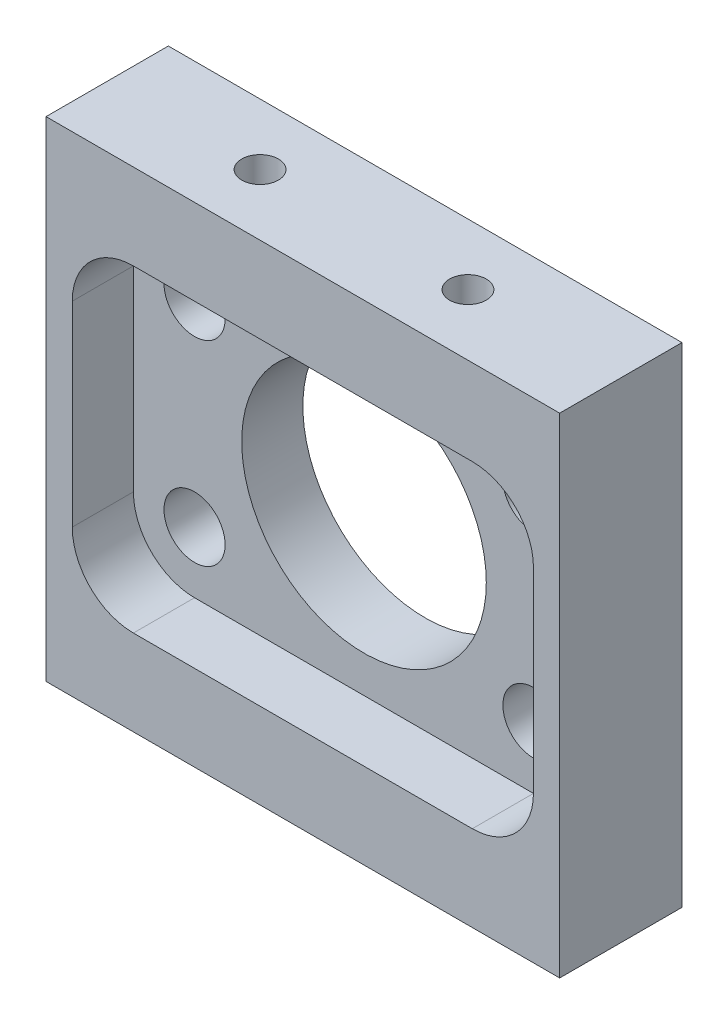
ISO-10303-21;
HEADER;
FILE_DESCRIPTION(('STEP AP214'),'2;1');
FILE_NAME('part.step','',(''),(''),'','','');
FILE_SCHEMA(('AUTOMOTIVE_DESIGN { 1 0 10303 214 1 1 1 1 }'));
ENDSEC;
DATA;
#1=APPLICATION_CONTEXT('core data for automotive mechanical design processes');
#2=APPLICATION_PROTOCOL_DEFINITION('international standard','automotive_design',2000,#1);
#3=PRODUCT_CONTEXT('',#1,'mechanical');
#4=PRODUCT('Part','Part','',(#3));
#5=PRODUCT_RELATED_PRODUCT_CATEGORY('part','',(#4));
#6=PRODUCT_DEFINITION_FORMATION('','',#4);
#7=PRODUCT_DEFINITION_CONTEXT('part definition',#1,'design');
#8=PRODUCT_DEFINITION('design','',#6,#7);
#9=PRODUCT_DEFINITION_SHAPE('','',#8);
#10=(LENGTH_UNIT() NAMED_UNIT(*) SI_UNIT(.MILLI.,.METRE.));
#11=(NAMED_UNIT(*) PLANE_ANGLE_UNIT() SI_UNIT($,.RADIAN.));
#12=(NAMED_UNIT(*) SI_UNIT($,.STERADIAN.) SOLID_ANGLE_UNIT());
#13=UNCERTAINTY_MEASURE_WITH_UNIT(LENGTH_MEASURE(1.E-05),#10,'distance_accuracy_value','');
#14=(GEOMETRIC_REPRESENTATION_CONTEXT(3) GLOBAL_UNCERTAINTY_ASSIGNED_CONTEXT((#13)) GLOBAL_UNIT_ASSIGNED_CONTEXT((#10,
#11,#12)) REPRESENTATION_CONTEXT('',''));
#15=CARTESIAN_POINT('',(0.,0.,0.));
#16=DIRECTION('',(0.,0.,1.));
#17=DIRECTION('',(1.,0.,0.));
#18=AXIS2_PLACEMENT_3D('',#15,#16,#17);
#19=CARTESIAN_POINT('',(0.,-10.,2.5));
#20=DIRECTION('',(0.,1.,0.));
#21=DIRECTION('',(0.,0.,1.));
#22=AXIS2_PLACEMENT_3D('',#19,#20,#21);
#23=PLANE('',#22);
#24=CARTESIAN_POINT('',(-4.25,-10.,0.));
#25=DIRECTION('',(0.,1.,0.));
#26=DIRECTION('',(0.,0.,1.));
#27=AXIS2_PLACEMENT_3D('',#24,#25,#26);
#28=CIRCLE('',#27,0.749999999999999);
#29=CARTESIAN_POINT('',(-4.25,-10.,0.749999999999999));
#30=VERTEX_POINT('',#29);
#31=EDGE_CURVE('E484',#30,#30,#28,.T.);
#32=ORIENTED_EDGE('',*,*,#31,.T.);
#33=EDGE_LOOP('',(#32));
#34=FACE_BOUND('',#33,.T.);
#35=DIRECTION('',(1.,0.,0.));
#36=VECTOR('',#35,1.);
#37=CARTESIAN_POINT('',(0.,-10.,-2.5));
#38=LINE('',#37,#36);
#39=CARTESIAN_POINT('',(-10.5,-10.,-2.5));
#40=VERTEX_POINT('',#39);
#41=CARTESIAN_POINT('',(10.5,-10.,-2.5));
#42=VERTEX_POINT('',#41);
#43=EDGE_CURVE('E229',#40,#42,#38,.T.);
#44=ORIENTED_EDGE('',*,*,#43,.T.);
#45=DIRECTION('',(0.,0.,-1.));
#46=VECTOR('',#45,1.);
#47=CARTESIAN_POINT('',(10.5,-10.,2.5));
#48=LINE('',#47,#46);
#49=CARTESIAN_POINT('',(10.5,-10.,2.5));
#50=VERTEX_POINT('',#49);
#51=EDGE_CURVE('E79',#50,#42,#48,.T.);
#52=ORIENTED_EDGE('',*,*,#51,.F.);
#53=DIRECTION('',(1.,0.,0.));
#54=VECTOR('',#53,1.);
#55=CARTESIAN_POINT('',(0.,-10.,2.5));
#56=LINE('',#55,#54);
#57=CARTESIAN_POINT('',(-10.5,-10.,2.5));
#58=VERTEX_POINT('',#57);
#59=EDGE_CURVE('E59',#58,#50,#56,.T.);
#60=ORIENTED_EDGE('',*,*,#59,.F.);
#61=DIRECTION('',(0.,0.,-1.));
#62=VECTOR('',#61,1.);
#63=CARTESIAN_POINT('',(-10.5,-10.,2.5));
#64=LINE('',#63,#62);
#65=EDGE_CURVE('E246',#58,#40,#64,.T.);
#66=ORIENTED_EDGE('',*,*,#65,.T.);
#67=EDGE_LOOP('',(#44,#52,#60,#66));
#68=FACE_BOUND('',#67,.T.);
#69=CARTESIAN_POINT('',(4.25,-10.,0.));
#70=DIRECTION('',(0.,1.,0.));
#71=DIRECTION('',(0.,0.,1.));
#72=AXIS2_PLACEMENT_3D('',#69,#70,#71);
#73=CIRCLE('',#72,0.750000000000001);
#74=CARTESIAN_POINT('',(4.25,-10.,0.750000000000001));
#75=VERTEX_POINT('',#74);
#76=EDGE_CURVE('E485',#75,#75,#73,.T.);
#77=ORIENTED_EDGE('',*,*,#76,.T.);
#78=EDGE_LOOP('',(#77));
#79=FACE_BOUND('',#78,.T.);
#80=ADVANCED_FACE('F34',(#34,#68,#79),#23,.F.);
#81=CARTESIAN_POINT('',(6.92820323027552,3.99999999999999,2.5));
#82=DIRECTION('',(0.,0.,-1.));
#83=DIRECTION('',(-1.,0.,0.));
#84=AXIS2_PLACEMENT_3D('',#81,#82,#83);
#85=CYLINDRICAL_SURFACE('',#84,1.25);
#86=CARTESIAN_POINT('',(6.92820323027552,3.99999999999999,-2.5));
#87=DIRECTION('',(0.,0.,1.));
#88=DIRECTION('',(1.,0.,0.));
#89=AXIS2_PLACEMENT_3D('',#86,#87,#88);
#90=CIRCLE('',#89,1.25);
#91=CARTESIAN_POINT('',(8.17820323027552,3.99999999999999,-2.5));
#92=VERTEX_POINT('',#91);
#93=EDGE_CURVE('E240',#92,#92,#90,.T.);
#94=ORIENTED_EDGE('',*,*,#93,.F.);
#95=EDGE_LOOP('',(#94));
#96=FACE_BOUND('',#95,.T.);
#97=CARTESIAN_POINT('',(6.92820323027552,3.99999999999999,0.));
#98=DIRECTION('',(0.,0.,1.));
#99=DIRECTION('',(1.,0.,0.));
#100=AXIS2_PLACEMENT_3D('',#97,#98,#99);
#101=CIRCLE('',#100,1.25);
#102=CARTESIAN_POINT('',(8.17820323027552,3.99999999999999,0.));
#103=VERTEX_POINT('',#102);
#104=EDGE_CURVE('E209',#103,#103,#101,.T.);
#105=ORIENTED_EDGE('',*,*,#104,.T.);
#106=EDGE_LOOP('',(#105));
#107=FACE_BOUND('',#106,.T.);
#108=ADVANCED_FACE('F272',(#96,#107),#85,.F.);
#109=CARTESIAN_POINT('',(-6.92820323027552,-3.99999999999998,2.5));
#110=DIRECTION('',(0.,0.,-1.));
#111=DIRECTION('',(-1.,0.,0.));
#112=AXIS2_PLACEMENT_3D('',#109,#110,#111);
#113=CYLINDRICAL_SURFACE('',#112,1.25);
#114=CARTESIAN_POINT('',(-6.92820323027552,-3.99999999999998,-2.5));
#115=DIRECTION('',(0.,0.,1.));
#116=DIRECTION('',(1.,0.,0.));
#117=AXIS2_PLACEMENT_3D('',#114,#115,#116);
#118=CIRCLE('',#117,1.25);
#119=CARTESIAN_POINT('',(-5.67820323027552,-3.99999999999998,-2.5));
#120=VERTEX_POINT('',#119);
#121=EDGE_CURVE('E237',#120,#120,#118,.T.);
#122=ORIENTED_EDGE('',*,*,#121,.F.);
#123=EDGE_LOOP('',(#122));
#124=FACE_BOUND('',#123,.T.);
#125=CARTESIAN_POINT('',(-6.92820323027552,-3.99999999999998,0.));
#126=DIRECTION('',(0.,0.,1.));
#127=DIRECTION('',(1.,0.,0.));
#128=AXIS2_PLACEMENT_3D('',#125,#126,#127);
#129=CIRCLE('',#128,1.25);
#130=CARTESIAN_POINT('',(-5.67820323027552,-3.99999999999998,0.));
#131=VERTEX_POINT('',#130);
#132=EDGE_CURVE('E206',#131,#131,#129,.T.);
#133=ORIENTED_EDGE('',*,*,#132,.T.);
#134=EDGE_LOOP('',(#133));
#135=FACE_BOUND('',#134,.T.);
#136=ADVANCED_FACE('F278',(#124,#135),#113,.F.);
#137=CARTESIAN_POINT('',(-6.92820323027552,3.99999999999999,2.5));
#138=DIRECTION('',(0.,0.,-1.));
#139=DIRECTION('',(-1.,0.,0.));
#140=AXIS2_PLACEMENT_3D('',#137,#138,#139);
#141=CYLINDRICAL_SURFACE('',#140,1.25);
#142=CARTESIAN_POINT('',(-6.92820323027552,3.99999999999999,-2.5));
#143=DIRECTION('',(0.,0.,1.));
#144=DIRECTION('',(1.,0.,0.));
#145=AXIS2_PLACEMENT_3D('',#142,#143,#144);
#146=CIRCLE('',#145,1.25);
#147=CARTESIAN_POINT('',(-5.67820323027552,3.99999999999999,-2.5));
#148=VERTEX_POINT('',#147);
#149=EDGE_CURVE('E234',#148,#148,#146,.T.);
#150=ORIENTED_EDGE('',*,*,#149,.F.);
#151=EDGE_LOOP('',(#150));
#152=FACE_BOUND('',#151,.T.);
#153=CARTESIAN_POINT('',(-6.92820323027552,3.99999999999999,0.));
#154=DIRECTION('',(0.,0.,1.));
#155=DIRECTION('',(1.,0.,0.));
#156=AXIS2_PLACEMENT_3D('',#153,#154,#155);
#157=CIRCLE('',#156,1.25);
#158=CARTESIAN_POINT('',(-5.67820323027552,3.99999999999999,0.));
#159=VERTEX_POINT('',#158);
#160=EDGE_CURVE('E203',#159,#159,#157,.T.);
#161=ORIENTED_EDGE('',*,*,#160,.T.);
#162=EDGE_LOOP('',(#161));
#163=FACE_BOUND('',#162,.T.);
#164=ADVANCED_FACE('F301',(#152,#163),#141,.F.);
#165=CARTESIAN_POINT('',(6.92820323027552,-3.99999999999999,2.5));
#166=DIRECTION('',(0.,0.,-1.));
#167=DIRECTION('',(-1.,0.,0.));
#168=AXIS2_PLACEMENT_3D('',#165,#166,#167);
#169=CYLINDRICAL_SURFACE('',#168,1.25);
#170=CARTESIAN_POINT('',(6.92820323027552,-3.99999999999999,-2.5));
#171=DIRECTION('',(0.,0.,1.));
#172=DIRECTION('',(1.,0.,0.));
#173=AXIS2_PLACEMENT_3D('',#170,#171,#172);
#174=CIRCLE('',#173,1.25);
#175=CARTESIAN_POINT('',(8.17820323027552,-3.99999999999999,-2.5));
#176=VERTEX_POINT('',#175);
#177=EDGE_CURVE('E231',#176,#176,#174,.T.);
#178=ORIENTED_EDGE('',*,*,#177,.F.);
#179=EDGE_LOOP('',(#178));
#180=FACE_BOUND('',#179,.T.);
#181=CARTESIAN_POINT('',(6.92820323027552,-3.99999999999999,0.));
#182=DIRECTION('',(0.,0.,1.));
#183=DIRECTION('',(1.,0.,0.));
#184=AXIS2_PLACEMENT_3D('',#181,#182,#183);
#185=CIRCLE('',#184,1.25);
#186=CARTESIAN_POINT('',(8.17820323027552,-3.99999999999999,0.));
#187=VERTEX_POINT('',#186);
#188=EDGE_CURVE('E200',#187,#187,#185,.T.);
#189=ORIENTED_EDGE('',*,*,#188,.T.);
#190=EDGE_LOOP('',(#189));
#191=FACE_BOUND('',#190,.T.);
#192=ADVANCED_FACE('F285',(#180,#191),#169,.F.);
#193=CARTESIAN_POINT('',(0.,0.,2.5));
#194=DIRECTION('',(0.,0.,-1.));
#195=DIRECTION('',(-1.,0.,0.));
#196=AXIS2_PLACEMENT_3D('',#193,#194,#195);
#197=CYLINDRICAL_SURFACE('',#196,5.);
#198=CARTESIAN_POINT('',(0.,0.,-2.5));
#199=DIRECTION('',(0.,0.,1.));
#200=DIRECTION('',(1.,0.,0.));
#201=AXIS2_PLACEMENT_3D('',#198,#199,#200);
#202=CIRCLE('',#201,5.);
#203=CARTESIAN_POINT('',(5.,0.,-2.5));
#204=VERTEX_POINT('',#203);
#205=EDGE_CURVE('E216',#204,#204,#202,.T.);
#206=ORIENTED_EDGE('',*,*,#205,.F.);
#207=EDGE_LOOP('',(#206));
#208=FACE_BOUND('',#207,.T.);
#209=CARTESIAN_POINT('',(0.,0.,0.));
#210=DIRECTION('',(0.,0.,1.));
#211=DIRECTION('',(1.,0.,0.));
#212=AXIS2_PLACEMENT_3D('',#209,#210,#211);
#213=CIRCLE('',#212,5.);
#214=CARTESIAN_POINT('',(5.,0.,0.));
#215=VERTEX_POINT('',#214);
#216=EDGE_CURVE('E38',#215,#215,#213,.T.);
#217=ORIENTED_EDGE('',*,*,#216,.T.);
#218=EDGE_LOOP('',(#217));
#219=FACE_BOUND('',#218,.T.);
#220=ADVANCED_FACE('F269',(#208,#219),#197,.F.);
#221=CARTESIAN_POINT('',(0.,0.,2.5));
#222=DIRECTION('',(0.,0.,1.));
#223=DIRECTION('',(1.,0.,0.));
#224=AXIS2_PLACEMENT_3D('',#221,#222,#223);
#225=PLANE('',#224);
#226=DIRECTION('',(0.,-1.,0.));
#227=VECTOR('',#226,1.);
#228=CARTESIAN_POINT('',(10.5,0.,2.5));
#229=LINE('',#228,#227);
#230=CARTESIAN_POINT('',(10.5,10.,2.5));
#231=VERTEX_POINT('',#230);
#232=EDGE_CURVE('E213',#231,#50,#229,.T.);
#233=ORIENTED_EDGE('',*,*,#232,.F.);
#234=DIRECTION('',(1.,0.,0.));
#235=VECTOR('',#234,1.);
#236=CARTESIAN_POINT('',(0.,10.,2.5));
#237=LINE('',#236,#235);
#238=CARTESIAN_POINT('',(-10.5,10.,2.5));
#239=VERTEX_POINT('',#238);
#240=EDGE_CURVE('E215',#239,#231,#237,.T.);
#241=ORIENTED_EDGE('',*,*,#240,.F.);
#242=DIRECTION('',(0.,-1.,0.));
#243=VECTOR('',#242,1.);
#244=CARTESIAN_POINT('',(-10.5,0.,2.5));
#245=LINE('',#244,#243);
#246=EDGE_CURVE('E219',#239,#58,#245,.T.);
#247=ORIENTED_EDGE('',*,*,#246,.T.);
#248=ORIENTED_EDGE('',*,*,#59,.T.);
#249=EDGE_LOOP('',(#233,#241,#247,#248));
#250=FACE_BOUND('',#249,.T.);
#251=CARTESIAN_POINT('',(-6.92820323027552,-3.99999999999998,2.5));
#252=DIRECTION('',(0.,0.,1.));
#253=DIRECTION('',(1.,0.,0.));
#254=AXIS2_PLACEMENT_3D('',#251,#252,#253);
#255=CIRCLE('',#254,2.5);
#256=CARTESIAN_POINT('',(-9.42820323027552,-3.99999999999998,2.5));
#257=VERTEX_POINT('',#256);
#258=CARTESIAN_POINT('',(-6.92820323027551,-6.49999999999999,2.5));
#259=VERTEX_POINT('',#258);
#260=EDGE_CURVE('E138',#257,#259,#255,.T.);
#261=ORIENTED_EDGE('',*,*,#260,.F.);
#262=DIRECTION('',(0.,1.,0.));
#263=VECTOR('',#262,1.);
#264=CARTESIAN_POINT('',(-9.42820323027552,0.,2.5));
#265=LINE('',#264,#263);
#266=CARTESIAN_POINT('',(-9.42820323027552,3.99999999999998,2.5));
#267=VERTEX_POINT('',#266);
#268=EDGE_CURVE('E50',#257,#267,#265,.T.);
#269=ORIENTED_EDGE('',*,*,#268,.T.);
#270=CARTESIAN_POINT('',(-6.92820323027552,3.99999999999999,2.5));
#271=DIRECTION('',(0.,0.,1.));
#272=DIRECTION('',(1.,0.,0.));
#273=AXIS2_PLACEMENT_3D('',#270,#271,#272);
#274=CIRCLE('',#273,2.5);
#275=CARTESIAN_POINT('',(-6.92820323027552,6.49999999999999,2.5));
#276=VERTEX_POINT('',#275);
#277=EDGE_CURVE('E145',#276,#267,#274,.T.);
#278=ORIENTED_EDGE('',*,*,#277,.F.);
#279=DIRECTION('',(-1.,0.,0.));
#280=VECTOR('',#279,1.);
#281=CARTESIAN_POINT('',(0.,6.49999999999999,2.5));
#282=LINE('',#281,#280);
#283=CARTESIAN_POINT('',(6.92820323027552,6.49999999999999,2.5));
#284=VERTEX_POINT('',#283);
#285=EDGE_CURVE('E171',#284,#276,#282,.T.);
#286=ORIENTED_EDGE('',*,*,#285,.F.);
#287=CARTESIAN_POINT('',(6.92820323027552,3.99999999999999,2.5));
#288=DIRECTION('',(0.,0.,1.));
#289=DIRECTION('',(1.,0.,0.));
#290=AXIS2_PLACEMENT_3D('',#287,#288,#289);
#291=CIRCLE('',#290,2.50000000000001);
#292=CARTESIAN_POINT('',(9.42820323027552,3.99999999999999,2.5));
#293=VERTEX_POINT('',#292);
#294=EDGE_CURVE('E174',#293,#284,#291,.T.);
#295=ORIENTED_EDGE('',*,*,#294,.F.);
#296=DIRECTION('',(0.,1.,0.));
#297=VECTOR('',#296,1.);
#298=CARTESIAN_POINT('',(9.42820323027553,0.,2.5));
#299=LINE('',#298,#297);
#300=CARTESIAN_POINT('',(9.42820323027553,-3.99999999999999,2.5));
#301=VERTEX_POINT('',#300);
#302=EDGE_CURVE('E177',#301,#293,#299,.T.);
#303=ORIENTED_EDGE('',*,*,#302,.F.);
#304=CARTESIAN_POINT('',(6.92820323027552,-3.99999999999999,2.5));
#305=DIRECTION('',(0.,0.,1.));
#306=DIRECTION('',(1.,0.,0.));
#307=AXIS2_PLACEMENT_3D('',#304,#305,#306);
#308=CIRCLE('',#307,2.50000000000001);
#309=CARTESIAN_POINT('',(6.92820323027552,-6.49999999999999,2.5));
#310=VERTEX_POINT('',#309);
#311=EDGE_CURVE('E180',#310,#301,#308,.T.);
#312=ORIENTED_EDGE('',*,*,#311,.F.);
#313=DIRECTION('',(-1.,0.,0.));
#314=VECTOR('',#313,1.);
#315=CARTESIAN_POINT('',(0.,-6.49999999999999,2.5));
#316=LINE('',#315,#314);
#317=EDGE_CURVE('E183',#310,#259,#316,.T.);
#318=ORIENTED_EDGE('',*,*,#317,.T.);
#319=EDGE_LOOP('',(#261,#269,#278,#286,#295,#303,#312,#318));
#320=FACE_BOUND('',#319,.T.);
#321=ADVANCED_FACE('F263',(#250,#320),#225,.T.);
#322=CARTESIAN_POINT('',(10.5,0.,2.5));
#323=DIRECTION('',(1.,0.,0.));
#324=DIRECTION('',(0.,0.,-1.));
#325=AXIS2_PLACEMENT_3D('',#322,#323,#324);
#326=PLANE('',#325);
#327=DIRECTION('',(0.,-1.,0.));
#328=VECTOR('',#327,1.);
#329=CARTESIAN_POINT('',(10.5,0.,-2.5));
#330=LINE('',#329,#328);
#331=CARTESIAN_POINT('',(10.5,10.,-2.5));
#332=VERTEX_POINT('',#331);
#333=EDGE_CURVE('E212',#332,#42,#330,.T.);
#334=ORIENTED_EDGE('',*,*,#333,.F.);
#335=DIRECTION('',(0.,0.,-1.));
#336=VECTOR('',#335,1.);
#337=CARTESIAN_POINT('',(10.5,10.,2.5));
#338=LINE('',#337,#336);
#339=EDGE_CURVE('E11',#231,#332,#338,.T.);
#340=ORIENTED_EDGE('',*,*,#339,.F.);
#341=ORIENTED_EDGE('',*,*,#232,.T.);
#342=ORIENTED_EDGE('',*,*,#51,.T.);
#343=EDGE_LOOP('',(#334,#340,#341,#342));
#344=FACE_BOUND('',#343,.T.);
#345=ADVANCED_FACE('F36',(#344),#326,.T.);
#346=CARTESIAN_POINT('',(0.,10.,2.5));
#347=DIRECTION('',(0.,1.,0.));
#348=DIRECTION('',(0.,0.,1.));
#349=AXIS2_PLACEMENT_3D('',#346,#347,#348);
#350=PLANE('',#349);
#351=CARTESIAN_POINT('',(4.25,10.,0.));
#352=DIRECTION('',(0.,1.,0.));
#353=DIRECTION('',(0.,0.,1.));
#354=AXIS2_PLACEMENT_3D('',#351,#352,#353);
#355=CIRCLE('',#354,0.750000000000001);
#356=CARTESIAN_POINT('',(4.25,10.,0.750000000000001));
#357=VERTEX_POINT('',#356);
#358=EDGE_CURVE('E493',#357,#357,#355,.T.);
#359=ORIENTED_EDGE('',*,*,#358,.F.);
#360=EDGE_LOOP('',(#359));
#361=FACE_BOUND('',#360,.T.);
#362=CARTESIAN_POINT('',(-4.25,10.,0.));
#363=DIRECTION('',(0.,1.,0.));
#364=DIRECTION('',(0.,0.,1.));
#365=AXIS2_PLACEMENT_3D('',#362,#363,#364);
#366=CIRCLE('',#365,0.749999999999999);
#367=CARTESIAN_POINT('',(-4.25,10.,0.749999999999999));
#368=VERTEX_POINT('',#367);
#369=EDGE_CURVE('E498',#368,#368,#366,.T.);
#370=ORIENTED_EDGE('',*,*,#369,.F.);
#371=EDGE_LOOP('',(#370));
#372=FACE_BOUND('',#371,.T.);
#373=DIRECTION('',(1.,0.,0.));
#374=VECTOR('',#373,1.);
#375=CARTESIAN_POINT('',(0.,10.,-2.5));
#376=LINE('',#375,#374);
#377=CARTESIAN_POINT('',(-10.5,10.,-2.5));
#378=VERTEX_POINT('',#377);
#379=EDGE_CURVE('E224',#378,#332,#376,.T.);
#380=ORIENTED_EDGE('',*,*,#379,.F.);
#381=DIRECTION('',(0.,0.,-1.));
#382=VECTOR('',#381,1.);
#383=CARTESIAN_POINT('',(-10.5,10.,2.5));
#384=LINE('',#383,#382);
#385=EDGE_CURVE('E43',#239,#378,#384,.T.);
#386=ORIENTED_EDGE('',*,*,#385,.F.);
#387=ORIENTED_EDGE('',*,*,#240,.T.);
#388=ORIENTED_EDGE('',*,*,#339,.T.);
#389=EDGE_LOOP('',(#380,#386,#387,#388));
#390=FACE_BOUND('',#389,.T.);
#391=ADVANCED_FACE('F261',(#361,#372,#390),#350,.T.);
#392=CARTESIAN_POINT('',(-10.5,0.,2.5));
#393=DIRECTION('',(1.,0.,0.));
#394=DIRECTION('',(0.,0.,-1.));
#395=AXIS2_PLACEMENT_3D('',#392,#393,#394);
#396=PLANE('',#395);
#397=DIRECTION('',(0.,-1.,0.));
#398=VECTOR('',#397,1.);
#399=CARTESIAN_POINT('',(-10.5,0.,-2.5));
#400=LINE('',#399,#398);
#401=EDGE_CURVE('E227',#378,#40,#400,.T.);
#402=ORIENTED_EDGE('',*,*,#401,.T.);
#403=ORIENTED_EDGE('',*,*,#65,.F.);
#404=ORIENTED_EDGE('',*,*,#246,.F.);
#405=ORIENTED_EDGE('',*,*,#385,.T.);
#406=EDGE_LOOP('',(#402,#403,#404,#405));
#407=FACE_BOUND('',#406,.T.);
#408=ADVANCED_FACE('F252',(#407),#396,.F.);
#409=CARTESIAN_POINT('',(0.,0.,-2.5));
#410=DIRECTION('',(0.,0.,1.));
#411=DIRECTION('',(1.,0.,0.));
#412=AXIS2_PLACEMENT_3D('',#409,#410,#411);
#413=PLANE('',#412);
#414=ORIENTED_EDGE('',*,*,#333,.T.);
#415=ORIENTED_EDGE('',*,*,#43,.F.);
#416=ORIENTED_EDGE('',*,*,#401,.F.);
#417=ORIENTED_EDGE('',*,*,#379,.T.);
#418=EDGE_LOOP('',(#414,#415,#416,#417));
#419=FACE_BOUND('',#418,.T.);
#420=ORIENTED_EDGE('',*,*,#177,.T.);
#421=EDGE_LOOP('',(#420));
#422=FACE_BOUND('',#421,.T.);
#423=ORIENTED_EDGE('',*,*,#149,.T.);
#424=EDGE_LOOP('',(#423));
#425=FACE_BOUND('',#424,.T.);
#426=ORIENTED_EDGE('',*,*,#121,.T.);
#427=EDGE_LOOP('',(#426));
#428=FACE_BOUND('',#427,.T.);
#429=ORIENTED_EDGE('',*,*,#93,.T.);
#430=EDGE_LOOP('',(#429));
#431=FACE_BOUND('',#430,.T.);
#432=ORIENTED_EDGE('',*,*,#205,.T.);
#433=EDGE_LOOP('',(#432));
#434=FACE_BOUND('',#433,.T.);
#435=ADVANCED_FACE('F259',(#419,#422,#425,#428,#431,#434),#413,.F.);
#436=CARTESIAN_POINT('',(-9.42820323027552,0.,0.));
#437=DIRECTION('',(1.,0.,0.));
#438=DIRECTION('',(0.,1.,0.));
#439=AXIS2_PLACEMENT_3D('',#436,#437,#438);
#440=PLANE('',#439);
#441=ORIENTED_EDGE('',*,*,#268,.F.);
#442=DIRECTION('',(0.,0.,1.));
#443=VECTOR('',#442,1.);
#444=CARTESIAN_POINT('',(-9.42820323027552,-3.99999999999998,0.));
#445=LINE('',#444,#443);
#446=CARTESIAN_POINT('',(-9.42820323027552,-3.99999999999998,0.));
#447=VERTEX_POINT('',#446);
#448=EDGE_CURVE('E132',#447,#257,#445,.T.);
#449=ORIENTED_EDGE('',*,*,#448,.F.);
#450=DIRECTION('',(0.,1.,0.));
#451=VECTOR('',#450,1.);
#452=CARTESIAN_POINT('',(-9.42820323027552,0.,0.));
#453=LINE('',#452,#451);
#454=CARTESIAN_POINT('',(-9.42820323027552,3.99999999999998,0.));
#455=VERTEX_POINT('',#454);
#456=EDGE_CURVE('E127',#447,#455,#453,.T.);
#457=ORIENTED_EDGE('',*,*,#456,.T.);
#458=DIRECTION('',(0.,0.,1.));
#459=VECTOR('',#458,1.);
#460=CARTESIAN_POINT('',(-9.42820323027552,3.99999999999998,0.));
#461=LINE('',#460,#459);
#462=EDGE_CURVE('E130',#455,#267,#461,.T.);
#463=ORIENTED_EDGE('',*,*,#462,.T.);
#464=EDGE_LOOP('',(#441,#449,#457,#463));
#465=FACE_BOUND('',#464,.T.);
#466=ADVANCED_FACE('F129',(#465),#440,.T.);
#467=CARTESIAN_POINT('',(-6.92820323027552,3.99999999999999,0.));
#468=DIRECTION('',(0.,0.,1.));
#469=DIRECTION('',(1.,0.,0.));
#470=AXIS2_PLACEMENT_3D('',#467,#468,#469);
#471=CYLINDRICAL_SURFACE('',#470,2.5);
#472=ORIENTED_EDGE('',*,*,#277,.T.);
#473=ORIENTED_EDGE('',*,*,#462,.F.);
#474=CARTESIAN_POINT('',(-6.92820323027552,3.99999999999999,0.));
#475=DIRECTION('',(0.,0.,1.));
#476=DIRECTION('',(1.,0.,0.));
#477=AXIS2_PLACEMENT_3D('',#474,#475,#476);
#478=CIRCLE('',#477,2.5);
#479=CARTESIAN_POINT('',(-6.92820323027552,6.49999999999999,0.));
#480=VERTEX_POINT('',#479);
#481=EDGE_CURVE('E137',#480,#455,#478,.T.);
#482=ORIENTED_EDGE('',*,*,#481,.F.);
#483=DIRECTION('',(0.,0.,1.));
#484=VECTOR('',#483,1.);
#485=CARTESIAN_POINT('',(-6.92820323027552,6.49999999999999,0.));
#486=LINE('',#485,#484);
#487=EDGE_CURVE('E146',#480,#276,#486,.T.);
#488=ORIENTED_EDGE('',*,*,#487,.T.);
#489=EDGE_LOOP('',(#472,#473,#482,#488));
#490=FACE_BOUND('',#489,.T.);
#491=ADVANCED_FACE('F142',(#490),#471,.F.);
#492=CARTESIAN_POINT('',(0.,6.49999999999999,0.));
#493=DIRECTION('',(0.,1.,0.));
#494=DIRECTION('',(-1.,0.,0.));
#495=AXIS2_PLACEMENT_3D('',#492,#493,#494);
#496=PLANE('',#495);
#497=ORIENTED_EDGE('',*,*,#285,.T.);
#498=ORIENTED_EDGE('',*,*,#487,.F.);
#499=DIRECTION('',(-1.,0.,0.));
#500=VECTOR('',#499,1.);
#501=CARTESIAN_POINT('',(0.,6.49999999999999,0.));
#502=LINE('',#501,#500);
#503=CARTESIAN_POINT('',(6.92820323027552,6.49999999999999,0.));
#504=VERTEX_POINT('',#503);
#505=EDGE_CURVE('E151',#504,#480,#502,.T.);
#506=ORIENTED_EDGE('',*,*,#505,.F.);
#507=DIRECTION('',(0.,0.,1.));
#508=VECTOR('',#507,1.);
#509=CARTESIAN_POINT('',(6.92820323027552,6.49999999999999,0.));
#510=LINE('',#509,#508);
#511=EDGE_CURVE('E197',#504,#284,#510,.T.);
#512=ORIENTED_EDGE('',*,*,#511,.T.);
#513=EDGE_LOOP('',(#497,#498,#506,#512));
#514=FACE_BOUND('',#513,.T.);
#515=ADVANCED_FACE('F353',(#514),#496,.F.);
#516=CARTESIAN_POINT('',(6.92820323027552,3.99999999999999,0.));
#517=DIRECTION('',(0.,0.,1.));
#518=DIRECTION('',(1.,0.,0.));
#519=AXIS2_PLACEMENT_3D('',#516,#517,#518);
#520=CYLINDRICAL_SURFACE('',#519,2.50000000000001);
#521=ORIENTED_EDGE('',*,*,#294,.T.);
#522=ORIENTED_EDGE('',*,*,#511,.F.);
#523=CARTESIAN_POINT('',(6.92820323027552,3.99999999999999,0.));
#524=DIRECTION('',(0.,0.,1.));
#525=DIRECTION('',(1.,0.,0.));
#526=AXIS2_PLACEMENT_3D('',#523,#524,#525);
#527=CIRCLE('',#526,2.50000000000001);
#528=CARTESIAN_POINT('',(9.42820323027552,3.99999999999999,0.));
#529=VERTEX_POINT('',#528);
#530=EDGE_CURVE('E153',#529,#504,#527,.T.);
#531=ORIENTED_EDGE('',*,*,#530,.F.);
#532=DIRECTION('',(0.,0.,1.));
#533=VECTOR('',#532,1.);
#534=CARTESIAN_POINT('',(9.42820323027552,3.99999999999999,0.));
#535=LINE('',#534,#533);
#536=EDGE_CURVE('E195',#529,#293,#535,.T.);
#537=ORIENTED_EDGE('',*,*,#536,.T.);
#538=EDGE_LOOP('',(#521,#522,#531,#537));
#539=FACE_BOUND('',#538,.T.);
#540=ADVANCED_FACE('F349',(#539),#520,.F.);
#541=CARTESIAN_POINT('',(9.42820323027553,0.,0.));
#542=DIRECTION('',(1.,0.,0.));
#543=DIRECTION('',(0.,0.,-1.));
#544=AXIS2_PLACEMENT_3D('',#541,#542,#543);
#545=PLANE('',#544);
#546=ORIENTED_EDGE('',*,*,#302,.T.);
#547=ORIENTED_EDGE('',*,*,#536,.F.);
#548=DIRECTION('',(0.,1.,0.));
#549=VECTOR('',#548,1.);
#550=CARTESIAN_POINT('',(9.42820323027553,0.,0.));
#551=LINE('',#550,#549);
#552=CARTESIAN_POINT('',(9.42820323027553,-3.99999999999999,0.));
#553=VERTEX_POINT('',#552);
#554=EDGE_CURVE('E158',#553,#529,#551,.T.);
#555=ORIENTED_EDGE('',*,*,#554,.F.);
#556=DIRECTION('',(0.,0.,1.));
#557=VECTOR('',#556,1.);
#558=CARTESIAN_POINT('',(9.42820323027553,-3.99999999999999,0.));
#559=LINE('',#558,#557);
#560=EDGE_CURVE('E193',#553,#301,#559,.T.);
#561=ORIENTED_EDGE('',*,*,#560,.T.);
#562=EDGE_LOOP('',(#546,#547,#555,#561));
#563=FACE_BOUND('',#562,.T.);
#564=ADVANCED_FACE('F345',(#563),#545,.F.);
#565=CARTESIAN_POINT('',(6.92820323027552,-3.99999999999999,0.));
#566=DIRECTION('',(0.,0.,1.));
#567=DIRECTION('',(1.,0.,0.));
#568=AXIS2_PLACEMENT_3D('',#565,#566,#567);
#569=CYLINDRICAL_SURFACE('',#568,2.50000000000001);
#570=ORIENTED_EDGE('',*,*,#311,.T.);
#571=ORIENTED_EDGE('',*,*,#560,.F.);
#572=CARTESIAN_POINT('',(6.92820323027552,-3.99999999999999,0.));
#573=DIRECTION('',(0.,0.,1.));
#574=DIRECTION('',(1.,0.,0.));
#575=AXIS2_PLACEMENT_3D('',#572,#573,#574);
#576=CIRCLE('',#575,2.50000000000001);
#577=CARTESIAN_POINT('',(6.92820323027552,-6.49999999999999,0.));
#578=VERTEX_POINT('',#577);
#579=EDGE_CURVE('E161',#578,#553,#576,.T.);
#580=ORIENTED_EDGE('',*,*,#579,.F.);
#581=DIRECTION('',(0.,0.,1.));
#582=VECTOR('',#581,1.);
#583=CARTESIAN_POINT('',(6.92820323027552,-6.49999999999999,0.));
#584=LINE('',#583,#582);
#585=EDGE_CURVE('E191',#578,#310,#584,.T.);
#586=ORIENTED_EDGE('',*,*,#585,.T.);
#587=EDGE_LOOP('',(#570,#571,#580,#586));
#588=FACE_BOUND('',#587,.T.);
#589=ADVANCED_FACE('F341',(#588),#569,.F.);
#590=CARTESIAN_POINT('',(0.,-6.49999999999999,0.));
#591=DIRECTION('',(0.,1.,0.));
#592=DIRECTION('',(-1.,0.,0.));
#593=AXIS2_PLACEMENT_3D('',#590,#591,#592);
#594=PLANE('',#593);
#595=ORIENTED_EDGE('',*,*,#317,.F.);
#596=ORIENTED_EDGE('',*,*,#585,.F.);
#597=DIRECTION('',(-1.,0.,0.));
#598=VECTOR('',#597,1.);
#599=CARTESIAN_POINT('',(0.,-6.49999999999999,0.));
#600=LINE('',#599,#598);
#601=CARTESIAN_POINT('',(-6.92820323027551,-6.49999999999999,0.));
#602=VERTEX_POINT('',#601);
#603=EDGE_CURVE('E164',#578,#602,#600,.T.);
#604=ORIENTED_EDGE('',*,*,#603,.T.);
#605=DIRECTION('',(0.,0.,1.));
#606=VECTOR('',#605,1.);
#607=CARTESIAN_POINT('',(-6.92820323027551,-6.49999999999999,0.));
#608=LINE('',#607,#606);
#609=EDGE_CURVE('E189',#602,#259,#608,.T.);
#610=ORIENTED_EDGE('',*,*,#609,.T.);
#611=EDGE_LOOP('',(#595,#596,#604,#610));
#612=FACE_BOUND('',#611,.T.);
#613=ADVANCED_FACE('F332',(#612),#594,.T.);
#614=CARTESIAN_POINT('',(-6.92820323027552,-3.99999999999998,0.));
#615=DIRECTION('',(0.,0.,1.));
#616=DIRECTION('',(1.,0.,0.));
#617=AXIS2_PLACEMENT_3D('',#614,#615,#616);
#618=CYLINDRICAL_SURFACE('',#617,2.5);
#619=ORIENTED_EDGE('',*,*,#260,.T.);
#620=ORIENTED_EDGE('',*,*,#609,.F.);
#621=CARTESIAN_POINT('',(-6.92820323027552,-3.99999999999998,0.));
#622=DIRECTION('',(0.,0.,1.));
#623=DIRECTION('',(1.,0.,0.));
#624=AXIS2_PLACEMENT_3D('',#621,#622,#623);
#625=CIRCLE('',#624,2.5);
#626=EDGE_CURVE('E166',#447,#602,#625,.T.);
#627=ORIENTED_EDGE('',*,*,#626,.F.);
#628=ORIENTED_EDGE('',*,*,#448,.T.);
#629=EDGE_LOOP('',(#619,#620,#627,#628));
#630=FACE_BOUND('',#629,.T.);
#631=ADVANCED_FACE('F316',(#630),#618,.F.);
#632=CARTESIAN_POINT('',(-6.92820323027552,3.99999999999999,0.));
#633=DIRECTION('',(0.,0.,1.));
#634=DIRECTION('',(1.,0.,0.));
#635=AXIS2_PLACEMENT_3D('',#632,#633,#634);
#636=PLANE('',#635);
#637=ORIENTED_EDGE('',*,*,#104,.F.);
#638=EDGE_LOOP('',(#637));
#639=FACE_BOUND('',#638,.T.);
#640=ORIENTED_EDGE('',*,*,#132,.F.);
#641=EDGE_LOOP('',(#640));
#642=FACE_BOUND('',#641,.T.);
#643=ORIENTED_EDGE('',*,*,#160,.F.);
#644=EDGE_LOOP('',(#643));
#645=FACE_BOUND('',#644,.T.);
#646=ORIENTED_EDGE('',*,*,#188,.F.);
#647=EDGE_LOOP('',(#646));
#648=FACE_BOUND('',#647,.T.);
#649=ORIENTED_EDGE('',*,*,#216,.F.);
#650=EDGE_LOOP('',(#649));
#651=FACE_BOUND('',#650,.T.);
#652=ORIENTED_EDGE('',*,*,#456,.F.);
#653=ORIENTED_EDGE('',*,*,#626,.T.);
#654=ORIENTED_EDGE('',*,*,#603,.F.);
#655=ORIENTED_EDGE('',*,*,#579,.T.);
#656=ORIENTED_EDGE('',*,*,#554,.T.);
#657=ORIENTED_EDGE('',*,*,#530,.T.);
#658=ORIENTED_EDGE('',*,*,#505,.T.);
#659=ORIENTED_EDGE('',*,*,#481,.T.);
#660=EDGE_LOOP('',(#652,#653,#654,#655,#656,#657,#658,#659));
#661=FACE_BOUND('',#660,.T.);
#662=ADVANCED_FACE('F148',(#639,#642,#645,#648,#651,#661),#636,.T.);
#663=CARTESIAN_POINT('',(-4.25,7.,0.));
#664=DIRECTION('',(0.,1.,0.));
#665=DIRECTION('',(0.,0.,1.));
#666=AXIS2_PLACEMENT_3D('',#663,#664,#665);
#667=CYLINDRICAL_SURFACE('',#666,0.749999999999999);
#668=CARTESIAN_POINT('',(-4.25,7.,0.));
#669=DIRECTION('',(0.,1.,0.));
#670=DIRECTION('',(0.,0.,1.));
#671=AXIS2_PLACEMENT_3D('',#668,#669,#670);
#672=CIRCLE('',#671,0.749999999999999);
#673=CARTESIAN_POINT('',(-4.25,7.,0.749999999999999));
#674=VERTEX_POINT('',#673);
#675=EDGE_CURVE('E169',#674,#674,#672,.T.);
#676=ORIENTED_EDGE('',*,*,#675,.F.);
#677=EDGE_LOOP('',(#676));
#678=FACE_BOUND('',#677,.T.);
#679=ORIENTED_EDGE('',*,*,#369,.T.);
#680=EDGE_LOOP('',(#679));
#681=FACE_BOUND('',#680,.T.);
#682=ADVANCED_FACE('F315',(#678,#681),#667,.F.);
#683=CARTESIAN_POINT('',(-4.25,7.,0.));
#684=DIRECTION('',(0.,1.,0.));
#685=DIRECTION('',(0.,0.,1.));
#686=AXIS2_PLACEMENT_3D('',#683,#684,#685);
#687=PLANE('',#686);
#688=ORIENTED_EDGE('',*,*,#675,.T.);
#689=EDGE_LOOP('',(#688));
#690=FACE_BOUND('',#689,.T.);
#691=ADVANCED_FACE('F329',(#690),#687,.T.);
#692=CARTESIAN_POINT('',(4.25,7.,0.));
#693=DIRECTION('',(0.,1.,0.));
#694=DIRECTION('',(0.,0.,1.));
#695=AXIS2_PLACEMENT_3D('',#692,#693,#694);
#696=CYLINDRICAL_SURFACE('',#695,0.750000000000001);
#697=CARTESIAN_POINT('',(4.25,7.,0.));
#698=DIRECTION('',(0.,1.,0.));
#699=DIRECTION('',(0.,0.,1.));
#700=AXIS2_PLACEMENT_3D('',#697,#698,#699);
#701=CIRCLE('',#700,0.750000000000001);
#702=CARTESIAN_POINT('',(4.25,7.,0.750000000000001));
#703=VERTEX_POINT('',#702);
#704=EDGE_CURVE('E495',#703,#703,#701,.T.);
#705=ORIENTED_EDGE('',*,*,#704,.F.);
#706=EDGE_LOOP('',(#705));
#707=FACE_BOUND('',#706,.T.);
#708=ORIENTED_EDGE('',*,*,#358,.T.);
#709=EDGE_LOOP('',(#708));
#710=FACE_BOUND('',#709,.T.);
#711=ADVANCED_FACE('F414',(#707,#710),#696,.F.);
#712=CARTESIAN_POINT('',(4.25,7.,0.));
#713=DIRECTION('',(0.,1.,0.));
#714=DIRECTION('',(0.,0.,1.));
#715=AXIS2_PLACEMENT_3D('',#712,#713,#714);
#716=PLANE('',#715);
#717=ORIENTED_EDGE('',*,*,#704,.T.);
#718=EDGE_LOOP('',(#717));
#719=FACE_BOUND('',#718,.T.);
#720=ADVANCED_FACE('F423',(#719),#716,.T.);
#721=CARTESIAN_POINT('',(-4.25,-7.,0.));
#722=DIRECTION('',(0.,-1.,0.));
#723=DIRECTION('',(0.,0.,-1.));
#724=AXIS2_PLACEMENT_3D('',#721,#722,#723);
#725=CYLINDRICAL_SURFACE('',#724,0.749999999999999);
#726=CARTESIAN_POINT('',(-4.25,-7.,0.));
#727=DIRECTION('',(0.,1.,0.));
#728=DIRECTION('',(0.,0.,1.));
#729=AXIS2_PLACEMENT_3D('',#726,#727,#728);
#730=CIRCLE('',#729,0.749999999999999);
#731=CARTESIAN_POINT('',(-4.25,-7.,0.749999999999999));
#732=VERTEX_POINT('',#731);
#733=EDGE_CURVE('E487',#732,#732,#730,.T.);
#734=ORIENTED_EDGE('',*,*,#733,.T.);
#735=EDGE_LOOP('',(#734));
#736=FACE_BOUND('',#735,.T.);
#737=ORIENTED_EDGE('',*,*,#31,.F.);
#738=EDGE_LOOP('',(#737));
#739=FACE_BOUND('',#738,.T.);
#740=ADVANCED_FACE('F432',(#736,#739),#725,.F.);
#741=CARTESIAN_POINT('',(-4.25,-7.,0.));
#742=DIRECTION('',(0.,-1.,0.));
#743=DIRECTION('',(0.,0.,1.));
#744=AXIS2_PLACEMENT_3D('',#741,#742,#743);
#745=PLANE('',#744);
#746=ORIENTED_EDGE('',*,*,#733,.F.);
#747=EDGE_LOOP('',(#746));
#748=FACE_BOUND('',#747,.T.);
#749=ADVANCED_FACE('F447',(#748),#745,.T.);
#750=CARTESIAN_POINT('',(4.25,-7.,0.));
#751=DIRECTION('',(0.,-1.,0.));
#752=DIRECTION('',(0.,0.,-1.));
#753=AXIS2_PLACEMENT_3D('',#750,#751,#752);
#754=CYLINDRICAL_SURFACE('',#753,0.750000000000001);
#755=CARTESIAN_POINT('',(4.25,-7.,0.));
#756=DIRECTION('',(0.,1.,0.));
#757=DIRECTION('',(0.,0.,1.));
#758=AXIS2_PLACEMENT_3D('',#755,#756,#757);
#759=CIRCLE('',#758,0.750000000000001);
#760=CARTESIAN_POINT('',(4.25,-7.,0.750000000000001));
#761=VERTEX_POINT('',#760);
#762=EDGE_CURVE('E483',#761,#761,#759,.T.);
#763=ORIENTED_EDGE('',*,*,#762,.T.);
#764=EDGE_LOOP('',(#763));
#765=FACE_BOUND('',#764,.T.);
#766=ORIENTED_EDGE('',*,*,#76,.F.);
#767=EDGE_LOOP('',(#766));
#768=FACE_BOUND('',#767,.T.);
#769=ADVANCED_FACE('F457',(#765,#768),#754,.F.);
#770=CARTESIAN_POINT('',(4.25,-7.,0.));
#771=DIRECTION('',(0.,-1.,0.));
#772=DIRECTION('',(0.,0.,1.));
#773=AXIS2_PLACEMENT_3D('',#770,#771,#772);
#774=PLANE('',#773);
#775=ORIENTED_EDGE('',*,*,#762,.F.);
#776=EDGE_LOOP('',(#775));
#777=FACE_BOUND('',#776,.T.);
#778=ADVANCED_FACE('F467',(#777),#774,.T.);
#779=CLOSED_SHELL('',(#80,#108,#136,#164,#192,#220,#321,#345,#391,#408,#435,#466,#491,#515,#540,
#564,#589,#613,#631,#662,#682,#691,#711,#720,#740,#749,#769,#778));
#780=MANIFOLD_SOLID_BREP('B2',#779);
#781=ADVANCED_BREP_SHAPE_REPRESENTATION('',(#18,#780),#14);
#782=SHAPE_DEFINITION_REPRESENTATION(#9,#781);
ENDSEC;
END-ISO-10303-21;
